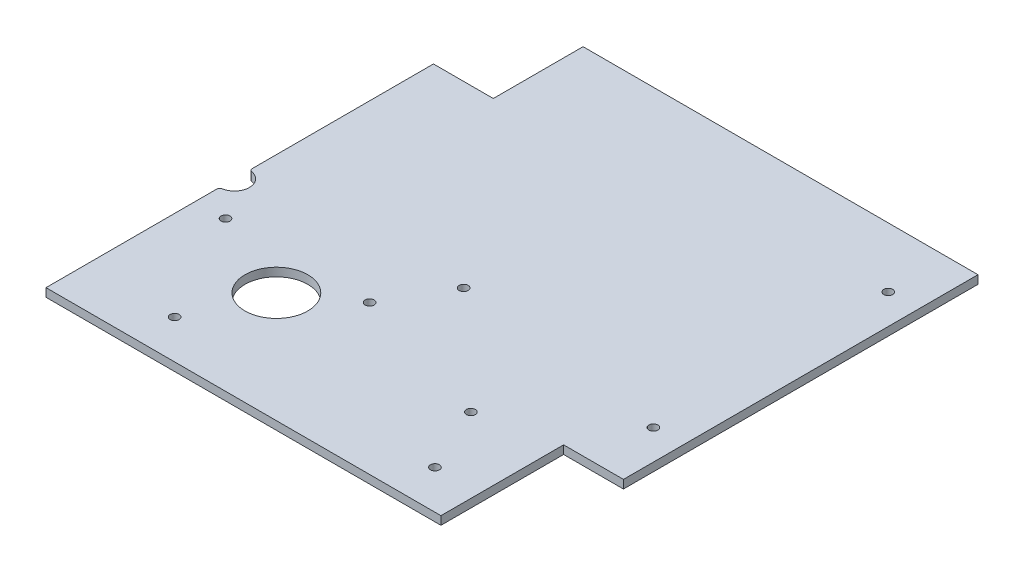
ISO-10303-21;
HEADER;
FILE_DESCRIPTION(('STEP AP214'),'2;1');
FILE_NAME('part.step','',(''),(''),'','','');
FILE_SCHEMA(('AUTOMOTIVE_DESIGN { 1 0 10303 214 1 1 1 1 }'));
ENDSEC;
DATA;
#1=APPLICATION_CONTEXT('core data for automotive mechanical design processes');
#2=APPLICATION_PROTOCOL_DEFINITION('international standard','automotive_design',2000,#1);
#3=PRODUCT_CONTEXT('',#1,'mechanical');
#4=PRODUCT('Part','Part','',(#3));
#5=PRODUCT_RELATED_PRODUCT_CATEGORY('part','',(#4));
#6=PRODUCT_DEFINITION_FORMATION('','',#4);
#7=PRODUCT_DEFINITION_CONTEXT('part definition',#1,'design');
#8=PRODUCT_DEFINITION('design','',#6,#7);
#9=PRODUCT_DEFINITION_SHAPE('','',#8);
#10=(LENGTH_UNIT() NAMED_UNIT(*) SI_UNIT(.MILLI.,.METRE.));
#11=(NAMED_UNIT(*) PLANE_ANGLE_UNIT() SI_UNIT($,.RADIAN.));
#12=(NAMED_UNIT(*) SI_UNIT($,.STERADIAN.) SOLID_ANGLE_UNIT());
#13=UNCERTAINTY_MEASURE_WITH_UNIT(LENGTH_MEASURE(1.E-05),#10,'distance_accuracy_value','');
#14=(GEOMETRIC_REPRESENTATION_CONTEXT(3) GLOBAL_UNCERTAINTY_ASSIGNED_CONTEXT((#13)) GLOBAL_UNIT_ASSIGNED_CONTEXT((#10,
#11,#12)) REPRESENTATION_CONTEXT('',''));
#15=CARTESIAN_POINT('',(0.,0.,0.));
#16=DIRECTION('',(0.,0.,1.));
#17=DIRECTION('',(1.,0.,0.));
#18=AXIS2_PLACEMENT_3D('',#15,#16,#17);
#19=CARTESIAN_POINT('',(-76.,2.8,0.));
#20=DIRECTION('',(-1.,0.,0.));
#21=DIRECTION('',(0.,0.,1.));
#22=AXIS2_PLACEMENT_3D('',#19,#20,#21);
#23=PLANE('',#22);
#24=DIRECTION('',(0.,0.,-1.));
#25=VECTOR('',#24,1.);
#26=CARTESIAN_POINT('',(-76.,2.8,0.));
#27=LINE('',#26,#25);
#28=CARTESIAN_POINT('',(-76.,2.8,79.75));
#29=VERTEX_POINT('',#28);
#30=CARTESIAN_POINT('',(-76.,2.8,22.6660797830996));
#31=VERTEX_POINT('',#30);
#32=EDGE_CURVE('E157',#29,#31,#27,.T.);
#33=ORIENTED_EDGE('',*,*,#32,.T.);
#34=DIRECTION('',(0.,-1.,0.));
#35=VECTOR('',#34,1.);
#36=CARTESIAN_POINT('',(-76.,0.,22.6660797830996));
#37=LINE('',#36,#35);
#38=CARTESIAN_POINT('',(-76.,0.,22.6660797830996));
#39=VERTEX_POINT('',#38);
#40=EDGE_CURVE('E133',#31,#39,#37,.T.);
#41=ORIENTED_EDGE('',*,*,#40,.T.);
#42=DIRECTION('',(0.,0.,-1.));
#43=VECTOR('',#42,1.);
#44=CARTESIAN_POINT('',(-76.,0.,0.));
#45=LINE('',#44,#43);
#46=CARTESIAN_POINT('',(-76.,0.,79.75));
#47=VERTEX_POINT('',#46);
#48=EDGE_CURVE('E193',#47,#39,#45,.T.);
#49=ORIENTED_EDGE('',*,*,#48,.F.);
#50=DIRECTION('',(0.,-1.,0.));
#51=VECTOR('',#50,1.);
#52=CARTESIAN_POINT('',(-76.,2.8,79.75));
#53=LINE('',#52,#51);
#54=EDGE_CURVE('E219',#29,#47,#53,.T.);
#55=ORIENTED_EDGE('',*,*,#54,.F.);
#56=EDGE_LOOP('',(#33,#41,#49,#55));
#57=FACE_BOUND('',#56,.T.);
#58=ADVANCED_FACE('F34',(#57),#23,.T.);
#59=CARTESIAN_POINT('',(0.,2.8,-79.75));
#60=DIRECTION('',(0.,0.,-1.));
#61=DIRECTION('',(-1.,0.,0.));
#62=AXIS2_PLACEMENT_3D('',#59,#60,#61);
#63=PLANE('',#62);
#64=DIRECTION('',(1.,0.,0.));
#65=VECTOR('',#64,1.);
#66=CARTESIAN_POINT('',(0.,0.,-79.75));
#67=LINE('',#66,#65);
#68=CARTESIAN_POINT('',(-56.,0.,-79.75));
#69=VERTEX_POINT('',#68);
#70=CARTESIAN_POINT('',(76.,0.,-79.75));
#71=VERTEX_POINT('',#70);
#72=EDGE_CURVE('E129',#69,#71,#67,.T.);
#73=ORIENTED_EDGE('',*,*,#72,.F.);
#74=DIRECTION('',(0.,-1.,0.));
#75=VECTOR('',#74,1.);
#76=CARTESIAN_POINT('',(-56.,2.8,-79.75));
#77=LINE('',#76,#75);
#78=CARTESIAN_POINT('',(-56.,2.8,-79.75));
#79=VERTEX_POINT('',#78);
#80=EDGE_CURVE('E123',#79,#69,#77,.T.);
#81=ORIENTED_EDGE('',*,*,#80,.F.);
#82=DIRECTION('',(1.,0.,0.));
#83=VECTOR('',#82,1.);
#84=CARTESIAN_POINT('',(0.,2.8,-79.75));
#85=LINE('',#84,#83);
#86=CARTESIAN_POINT('',(76.,2.8,-79.75));
#87=VERTEX_POINT('',#86);
#88=EDGE_CURVE('E127',#79,#87,#85,.T.);
#89=ORIENTED_EDGE('',*,*,#88,.T.);
#90=DIRECTION('',(0.,-1.,0.));
#91=VECTOR('',#90,1.);
#92=CARTESIAN_POINT('',(76.,2.8,-79.75));
#93=LINE('',#92,#91);
#94=EDGE_CURVE('E169',#87,#71,#93,.T.);
#95=ORIENTED_EDGE('',*,*,#94,.T.);
#96=EDGE_LOOP('',(#73,#81,#89,#95));
#97=FACE_BOUND('',#96,.T.);
#98=ADVANCED_FACE('F125',(#97),#63,.T.);
#99=CARTESIAN_POINT('',(-56.,2.8,0.));
#100=DIRECTION('',(1.,0.,0.));
#101=DIRECTION('',(0.,0.,-1.));
#102=AXIS2_PLACEMENT_3D('',#99,#100,#101);
#103=PLANE('',#102);
#104=DIRECTION('',(0.,0.,1.));
#105=VECTOR('',#104,1.);
#106=CARTESIAN_POINT('',(-56.,0.,0.));
#107=LINE('',#106,#105);
#108=CARTESIAN_POINT('',(-56.,0.,-49.75));
#109=VERTEX_POINT('',#108);
#110=EDGE_CURVE('E187',#69,#109,#107,.T.);
#111=ORIENTED_EDGE('',*,*,#110,.T.);
#112=DIRECTION('',(0.,-1.,0.));
#113=VECTOR('',#112,1.);
#114=CARTESIAN_POINT('',(-56.,2.8,-49.75));
#115=LINE('',#114,#113);
#116=CARTESIAN_POINT('',(-56.,2.8,-49.75));
#117=VERTEX_POINT('',#116);
#118=EDGE_CURVE('E134',#117,#109,#115,.T.);
#119=ORIENTED_EDGE('',*,*,#118,.F.);
#120=DIRECTION('',(0.,0.,1.));
#121=VECTOR('',#120,1.);
#122=CARTESIAN_POINT('',(-56.,2.8,0.));
#123=LINE('',#122,#121);
#124=EDGE_CURVE('E137',#79,#117,#123,.T.);
#125=ORIENTED_EDGE('',*,*,#124,.F.);
#126=ORIENTED_EDGE('',*,*,#80,.T.);
#127=EDGE_LOOP('',(#111,#119,#125,#126));
#128=FACE_BOUND('',#127,.T.);
#129=ADVANCED_FACE('F138',(#128),#103,.F.);
#130=CARTESIAN_POINT('',(0.,2.8,-49.75));
#131=DIRECTION('',(0.,0.,-1.));
#132=DIRECTION('',(-1.,0.,0.));
#133=AXIS2_PLACEMENT_3D('',#130,#131,#132);
#134=PLANE('',#133);
#135=DIRECTION('',(1.,0.,0.));
#136=VECTOR('',#135,1.);
#137=CARTESIAN_POINT('',(0.,0.,-49.75));
#138=LINE('',#137,#136);
#139=CARTESIAN_POINT('',(-76.,0.,-49.75));
#140=VERTEX_POINT('',#139);
#141=EDGE_CURVE('E189',#140,#109,#138,.T.);
#142=ORIENTED_EDGE('',*,*,#141,.F.);
#143=DIRECTION('',(0.,-1.,0.));
#144=VECTOR('',#143,1.);
#145=CARTESIAN_POINT('',(-76.,2.8,-49.75));
#146=LINE('',#145,#144);
#147=CARTESIAN_POINT('',(-76.,2.8,-49.75));
#148=VERTEX_POINT('',#147);
#149=EDGE_CURVE('E221',#148,#140,#146,.T.);
#150=ORIENTED_EDGE('',*,*,#149,.F.);
#151=DIRECTION('',(1.,0.,0.));
#152=VECTOR('',#151,1.);
#153=CARTESIAN_POINT('',(0.,2.8,-49.75));
#154=LINE('',#153,#152);
#155=EDGE_CURVE('E141',#148,#117,#154,.T.);
#156=ORIENTED_EDGE('',*,*,#155,.T.);
#157=ORIENTED_EDGE('',*,*,#118,.T.);
#158=EDGE_LOOP('',(#142,#150,#156,#157));
#159=FACE_BOUND('',#158,.T.);
#160=ADVANCED_FACE('F330',(#159),#134,.T.);
#161=CARTESIAN_POINT('',(-76.,0.,10.8339202169004));
#162=VERTEX_POINT('',#161);
#163=EDGE_CURVE('E192',#162,#140,#45,.T.);
#164=ORIENTED_EDGE('',*,*,#163,.F.);
#165=DIRECTION('',(0.,-1.,0.));
#166=VECTOR('',#165,1.);
#167=CARTESIAN_POINT('',(-76.,2.8,10.8339202169004));
#168=LINE('',#167,#166);
#169=CARTESIAN_POINT('',(-76.,2.8,10.8339202169004));
#170=VERTEX_POINT('',#169);
#171=EDGE_CURVE('E11',#162,#170,#168,.F.);
#172=ORIENTED_EDGE('',*,*,#171,.T.);
#173=EDGE_CURVE('E156',#170,#148,#27,.T.);
#174=ORIENTED_EDGE('',*,*,#173,.T.);
#175=ORIENTED_EDGE('',*,*,#149,.T.);
#176=EDGE_LOOP('',(#164,#172,#174,#175));
#177=FACE_BOUND('',#176,.T.);
#178=ADVANCED_FACE('F321',(#177),#23,.T.);
#179=CARTESIAN_POINT('',(0.,2.8,79.75));
#180=DIRECTION('',(0.,0.,-1.));
#181=DIRECTION('',(-1.,0.,0.));
#182=AXIS2_PLACEMENT_3D('',#179,#180,#181);
#183=PLANE('',#182);
#184=DIRECTION('',(1.,0.,0.));
#185=VECTOR('',#184,1.);
#186=CARTESIAN_POINT('',(0.,0.,79.75));
#187=LINE('',#186,#185);
#188=CARTESIAN_POINT('',(56.,0.,79.75));
#189=VERTEX_POINT('',#188);
#190=EDGE_CURVE('E196',#47,#189,#187,.T.);
#191=ORIENTED_EDGE('',*,*,#190,.T.);
#192=DIRECTION('',(0.,-1.,0.));
#193=VECTOR('',#192,1.);
#194=CARTESIAN_POINT('',(56.,2.8,79.75));
#195=LINE('',#194,#193);
#196=CARTESIAN_POINT('',(56.,2.8,79.75));
#197=VERTEX_POINT('',#196);
#198=EDGE_CURVE('E216',#197,#189,#195,.T.);
#199=ORIENTED_EDGE('',*,*,#198,.F.);
#200=DIRECTION('',(1.,0.,0.));
#201=VECTOR('',#200,1.);
#202=CARTESIAN_POINT('',(0.,2.8,79.75));
#203=LINE('',#202,#201);
#204=EDGE_CURVE('E160',#29,#197,#203,.T.);
#205=ORIENTED_EDGE('',*,*,#204,.F.);
#206=ORIENTED_EDGE('',*,*,#54,.T.);
#207=EDGE_LOOP('',(#191,#199,#205,#206));
#208=FACE_BOUND('',#207,.T.);
#209=ADVANCED_FACE('F329',(#208),#183,.F.);
#210=CARTESIAN_POINT('',(56.,2.8,0.));
#211=DIRECTION('',(-1.,0.,0.));
#212=DIRECTION('',(0.,0.,1.));
#213=AXIS2_PLACEMENT_3D('',#210,#211,#212);
#214=PLANE('',#213);
#215=DIRECTION('',(0.,0.,-1.));
#216=VECTOR('',#215,1.);
#217=CARTESIAN_POINT('',(56.,0.,0.));
#218=LINE('',#217,#216);
#219=CARTESIAN_POINT('',(56.,0.,38.75));
#220=VERTEX_POINT('',#219);
#221=EDGE_CURVE('E199',#189,#220,#218,.T.);
#222=ORIENTED_EDGE('',*,*,#221,.T.);
#223=DIRECTION('',(0.,-1.,0.));
#224=VECTOR('',#223,1.);
#225=CARTESIAN_POINT('',(56.,2.8,38.75));
#226=LINE('',#225,#224);
#227=CARTESIAN_POINT('',(56.,2.8,38.75));
#228=VERTEX_POINT('',#227);
#229=EDGE_CURVE('E213',#228,#220,#226,.T.);
#230=ORIENTED_EDGE('',*,*,#229,.F.);
#231=DIRECTION('',(0.,0.,-1.));
#232=VECTOR('',#231,1.);
#233=CARTESIAN_POINT('',(56.,2.8,0.));
#234=LINE('',#233,#232);
#235=EDGE_CURVE('E163',#197,#228,#234,.T.);
#236=ORIENTED_EDGE('',*,*,#235,.F.);
#237=ORIENTED_EDGE('',*,*,#198,.T.);
#238=EDGE_LOOP('',(#222,#230,#236,#237));
#239=FACE_BOUND('',#238,.T.);
#240=ADVANCED_FACE('F336',(#239),#214,.F.);
#241=CARTESIAN_POINT('',(0.,2.8,38.75));
#242=DIRECTION('',(0.,0.,-1.));
#243=DIRECTION('',(-1.,0.,0.));
#244=AXIS2_PLACEMENT_3D('',#241,#242,#243);
#245=PLANE('',#244);
#246=DIRECTION('',(1.,0.,0.));
#247=VECTOR('',#246,1.);
#248=CARTESIAN_POINT('',(0.,0.,38.75));
#249=LINE('',#248,#247);
#250=CARTESIAN_POINT('',(76.,0.,38.75));
#251=VERTEX_POINT('',#250);
#252=EDGE_CURVE('E202',#220,#251,#249,.T.);
#253=ORIENTED_EDGE('',*,*,#252,.T.);
#254=DIRECTION('',(0.,-1.,0.));
#255=VECTOR('',#254,1.);
#256=CARTESIAN_POINT('',(76.,2.8,38.75));
#257=LINE('',#256,#255);
#258=CARTESIAN_POINT('',(76.,2.8,38.75));
#259=VERTEX_POINT('',#258);
#260=EDGE_CURVE('E210',#259,#251,#257,.T.);
#261=ORIENTED_EDGE('',*,*,#260,.F.);
#262=DIRECTION('',(1.,0.,0.));
#263=VECTOR('',#262,1.);
#264=CARTESIAN_POINT('',(0.,2.8,38.75));
#265=LINE('',#264,#263);
#266=EDGE_CURVE('E166',#228,#259,#265,.T.);
#267=ORIENTED_EDGE('',*,*,#266,.F.);
#268=ORIENTED_EDGE('',*,*,#229,.T.);
#269=EDGE_LOOP('',(#253,#261,#267,#268));
#270=FACE_BOUND('',#269,.T.);
#271=ADVANCED_FACE('F302',(#270),#245,.F.);
#272=CARTESIAN_POINT('',(-66.,2.8,29.75));
#273=DIRECTION('',(0.,-1.,0.));
#274=DIRECTION('',(0.,0.,-1.));
#275=AXIS2_PLACEMENT_3D('',#272,#273,#274);
#276=CYLINDRICAL_SURFACE('',#275,1.5);
#277=CARTESIAN_POINT('',(-66.,2.8,29.75));
#278=DIRECTION('',(0.,1.,0.));
#279=DIRECTION('',(0.,0.,1.));
#280=AXIS2_PLACEMENT_3D('',#277,#278,#279);
#281=CIRCLE('',#280,1.5);
#282=CARTESIAN_POINT('',(-66.,2.8,31.25));
#283=VERTEX_POINT('',#282);
#284=EDGE_CURVE('E148',#283,#283,#281,.T.);
#285=ORIENTED_EDGE('',*,*,#284,.T.);
#286=EDGE_LOOP('',(#285));
#287=FACE_BOUND('',#286,.T.);
#288=CARTESIAN_POINT('',(-66.,0.,29.75));
#289=DIRECTION('',(0.,1.,0.));
#290=DIRECTION('',(0.,0.,1.));
#291=AXIS2_PLACEMENT_3D('',#288,#289,#290);
#292=CIRCLE('',#291,1.5);
#293=CARTESIAN_POINT('',(-66.,0.,31.25));
#294=VERTEX_POINT('',#293);
#295=EDGE_CURVE('E183',#294,#294,#292,.T.);
#296=ORIENTED_EDGE('',*,*,#295,.F.);
#297=EDGE_LOOP('',(#296));
#298=FACE_BOUND('',#297,.T.);
#299=ADVANCED_FACE('F299',(#287,#298),#276,.F.);
#300=CARTESIAN_POINT('',(41.,2.8,66.75));
#301=DIRECTION('',(0.,-1.,0.));
#302=DIRECTION('',(0.,0.,-1.));
#303=AXIS2_PLACEMENT_3D('',#300,#301,#302);
#304=CYLINDRICAL_SURFACE('',#303,1.5);
#305=CARTESIAN_POINT('',(41.,2.8,66.75));
#306=DIRECTION('',(0.,1.,0.));
#307=DIRECTION('',(0.,0.,1.));
#308=AXIS2_PLACEMENT_3D('',#305,#306,#307);
#309=CIRCLE('',#308,1.5);
#310=CARTESIAN_POINT('',(41.,2.8,68.25));
#311=VERTEX_POINT('',#310);
#312=EDGE_CURVE('E151',#311,#311,#309,.T.);
#313=ORIENTED_EDGE('',*,*,#312,.T.);
#314=EDGE_LOOP('',(#313));
#315=FACE_BOUND('',#314,.T.);
#316=CARTESIAN_POINT('',(41.,0.,66.75));
#317=DIRECTION('',(0.,1.,0.));
#318=DIRECTION('',(0.,0.,1.));
#319=AXIS2_PLACEMENT_3D('',#316,#317,#318);
#320=CIRCLE('',#319,1.5);
#321=CARTESIAN_POINT('',(41.,0.,68.25));
#322=VERTEX_POINT('',#321);
#323=EDGE_CURVE('E180',#322,#322,#320,.T.);
#324=ORIENTED_EDGE('',*,*,#323,.F.);
#325=EDGE_LOOP('',(#324));
#326=FACE_BOUND('',#325,.T.);
#327=ADVANCED_FACE('F290',(#315,#326),#304,.F.);
#328=CARTESIAN_POINT('',(-46.,2.8,66.75));
#329=DIRECTION('',(0.,-1.,0.));
#330=DIRECTION('',(0.,0.,-1.));
#331=AXIS2_PLACEMENT_3D('',#328,#329,#330);
#332=CYLINDRICAL_SURFACE('',#331,1.5);
#333=CARTESIAN_POINT('',(-46.,2.8,66.75));
#334=DIRECTION('',(0.,1.,0.));
#335=DIRECTION('',(0.,0.,1.));
#336=AXIS2_PLACEMENT_3D('',#333,#334,#335);
#337=CIRCLE('',#336,1.5);
#338=CARTESIAN_POINT('',(-46.,2.8,68.25));
#339=VERTEX_POINT('',#338);
#340=EDGE_CURVE('E285',#339,#339,#337,.T.);
#341=ORIENTED_EDGE('',*,*,#340,.T.);
#342=EDGE_LOOP('',(#341));
#343=FACE_BOUND('',#342,.T.);
#344=CARTESIAN_POINT('',(-46.,0.,66.75));
#345=DIRECTION('',(0.,1.,0.));
#346=DIRECTION('',(0.,0.,1.));
#347=AXIS2_PLACEMENT_3D('',#344,#345,#346);
#348=CIRCLE('',#347,1.5);
#349=CARTESIAN_POINT('',(-46.,0.,68.25));
#350=VERTEX_POINT('',#349);
#351=EDGE_CURVE('E177',#350,#350,#348,.T.);
#352=ORIENTED_EDGE('',*,*,#351,.F.);
#353=EDGE_LOOP('',(#352));
#354=FACE_BOUND('',#353,.T.);
#355=ADVANCED_FACE('F359',(#343,#354),#332,.F.);
#356=CARTESIAN_POINT('',(66.,2.8,-59.75));
#357=DIRECTION('',(0.,-1.,0.));
#358=DIRECTION('',(0.,0.,-1.));
#359=AXIS2_PLACEMENT_3D('',#356,#357,#358);
#360=CYLINDRICAL_SURFACE('',#359,1.5);
#361=CARTESIAN_POINT('',(66.,2.8,-59.75));
#362=DIRECTION('',(0.,1.,0.));
#363=DIRECTION('',(0.,0.,1.));
#364=AXIS2_PLACEMENT_3D('',#361,#362,#363);
#365=CIRCLE('',#364,1.5);
#366=CARTESIAN_POINT('',(66.,2.8,-58.25));
#367=VERTEX_POINT('',#366);
#368=EDGE_CURVE('E282',#367,#367,#365,.T.);
#369=ORIENTED_EDGE('',*,*,#368,.T.);
#370=EDGE_LOOP('',(#369));
#371=FACE_BOUND('',#370,.T.);
#372=CARTESIAN_POINT('',(66.,0.,-59.75));
#373=DIRECTION('',(0.,1.,0.));
#374=DIRECTION('',(0.,0.,1.));
#375=AXIS2_PLACEMENT_3D('',#372,#373,#374);
#376=CIRCLE('',#375,1.5);
#377=CARTESIAN_POINT('',(66.,0.,-58.25));
#378=VERTEX_POINT('',#377);
#379=EDGE_CURVE('E173',#378,#378,#376,.T.);
#380=ORIENTED_EDGE('',*,*,#379,.F.);
#381=EDGE_LOOP('',(#380));
#382=FACE_BOUND('',#381,.T.);
#383=ADVANCED_FACE('F355',(#371,#382),#360,.F.);
#384=CARTESIAN_POINT('',(66.,2.8,18.75));
#385=DIRECTION('',(0.,-1.,0.));
#386=DIRECTION('',(0.,0.,-1.));
#387=AXIS2_PLACEMENT_3D('',#384,#385,#386);
#388=CYLINDRICAL_SURFACE('',#387,1.5);
#389=CARTESIAN_POINT('',(66.,2.8,18.75));
#390=DIRECTION('',(0.,1.,0.));
#391=DIRECTION('',(0.,0.,1.));
#392=AXIS2_PLACEMENT_3D('',#389,#390,#391);
#393=CIRCLE('',#392,1.5);
#394=CARTESIAN_POINT('',(66.,2.8,20.25));
#395=VERTEX_POINT('',#394);
#396=EDGE_CURVE('E208',#395,#395,#393,.T.);
#397=ORIENTED_EDGE('',*,*,#396,.T.);
#398=EDGE_LOOP('',(#397));
#399=FACE_BOUND('',#398,.T.);
#400=CARTESIAN_POINT('',(66.,0.,18.75));
#401=DIRECTION('',(0.,1.,0.));
#402=DIRECTION('',(0.,0.,1.));
#403=AXIS2_PLACEMENT_3D('',#400,#401,#402);
#404=CIRCLE('',#403,1.5);
#405=CARTESIAN_POINT('',(66.,0.,20.25));
#406=VERTEX_POINT('',#405);
#407=EDGE_CURVE('E170',#406,#406,#404,.T.);
#408=ORIENTED_EDGE('',*,*,#407,.F.);
#409=EDGE_LOOP('',(#408));
#410=FACE_BOUND('',#409,.T.);
#411=ADVANCED_FACE('F352',(#399,#410),#388,.F.);
#412=CARTESIAN_POINT('',(76.,2.8,0.));
#413=DIRECTION('',(-1.,0.,0.));
#414=DIRECTION('',(0.,0.,1.));
#415=AXIS2_PLACEMENT_3D('',#412,#413,#414);
#416=PLANE('',#415);
#417=DIRECTION('',(0.,0.,-1.));
#418=VECTOR('',#417,1.);
#419=CARTESIAN_POINT('',(76.,0.,0.));
#420=LINE('',#419,#418);
#421=EDGE_CURVE('E205',#251,#71,#420,.T.);
#422=ORIENTED_EDGE('',*,*,#421,.T.);
#423=ORIENTED_EDGE('',*,*,#94,.F.);
#424=DIRECTION('',(0.,0.,-1.));
#425=VECTOR('',#424,1.);
#426=CARTESIAN_POINT('',(76.,2.8,0.));
#427=LINE('',#426,#425);
#428=EDGE_CURVE('E146',#259,#87,#427,.T.);
#429=ORIENTED_EDGE('',*,*,#428,.F.);
#430=ORIENTED_EDGE('',*,*,#260,.T.);
#431=EDGE_LOOP('',(#422,#423,#429,#430));
#432=FACE_BOUND('',#431,.T.);
#433=ADVANCED_FACE('F295',(#432),#416,.F.);
#434=CARTESIAN_POINT('',(0.,2.8,0.));
#435=DIRECTION('',(0.,1.,0.));
#436=DIRECTION('',(0.,0.,1.));
#437=AXIS2_PLACEMENT_3D('',#434,#435,#436);
#438=PLANE('',#437);
#439=CARTESIAN_POINT('',(-76.,2.8,16.75));
#440=DIRECTION('',(0.,1.,0.));
#441=DIRECTION('',(0.,0.,1.));
#442=AXIS2_PLACEMENT_3D('',#439,#440,#441);
#443=CIRCLE('',#442,5.);
#444=CARTESIAN_POINT('',(-75.1666666666667,2.8,21.6800664859163));
#445=VERTEX_POINT('',#444);
#446=CARTESIAN_POINT('',(-75.1666666666667,2.8,11.8199335140837));
#447=VERTEX_POINT('',#446);
#448=EDGE_CURVE('E237',#445,#447,#443,.T.);
#449=ORIENTED_EDGE('',*,*,#448,.F.);
#450=CARTESIAN_POINT('',(-75.,2.8,22.6660797830996));
#451=DIRECTION('',(0.,1.,0.));
#452=DIRECTION('',(0.,0.,1.));
#453=AXIS2_PLACEMENT_3D('',#450,#451,#452);
#454=CIRCLE('',#453,1.);
#455=EDGE_CURVE('E42',#445,#31,#454,.T.);
#456=ORIENTED_EDGE('',*,*,#455,.T.);
#457=ORIENTED_EDGE('',*,*,#32,.F.);
#458=ORIENTED_EDGE('',*,*,#204,.T.);
#459=ORIENTED_EDGE('',*,*,#235,.T.);
#460=ORIENTED_EDGE('',*,*,#266,.T.);
#461=ORIENTED_EDGE('',*,*,#428,.T.);
#462=ORIENTED_EDGE('',*,*,#88,.F.);
#463=ORIENTED_EDGE('',*,*,#124,.T.);
#464=ORIENTED_EDGE('',*,*,#155,.F.);
#465=ORIENTED_EDGE('',*,*,#173,.F.);
#466=CARTESIAN_POINT('',(-75.,2.8,10.8339202169004));
#467=DIRECTION('',(0.,1.,0.));
#468=DIRECTION('',(0.,0.,1.));
#469=AXIS2_PLACEMENT_3D('',#466,#467,#468);
#470=CIRCLE('',#469,1.);
#471=EDGE_CURVE('E49',#170,#447,#470,.T.);
#472=ORIENTED_EDGE('',*,*,#471,.T.);
#473=EDGE_LOOP('',(#449,#456,#457,#458,#459,#460,#461,#462,#463,#464,#465,#472));
#474=FACE_BOUND('',#473,.T.);
#475=CARTESIAN_POINT('',(-36.,2.8,42.75));
#476=DIRECTION('',(0.,1.,0.));
#477=DIRECTION('',(0.,0.,1.));
#478=AXIS2_PLACEMENT_3D('',#475,#476,#477);
#479=CIRCLE('',#478,10.5);
#480=CARTESIAN_POINT('',(-36.,2.8,53.25));
#481=VERTEX_POINT('',#480);
#482=EDGE_CURVE('E254',#481,#481,#479,.T.);
#483=ORIENTED_EDGE('',*,*,#482,.F.);
#484=EDGE_LOOP('',(#483));
#485=FACE_BOUND('',#484,.T.);
#486=CARTESIAN_POINT('',(31.,2.8,44.75));
#487=DIRECTION('',(0.,1.,0.));
#488=DIRECTION('',(0.,0.,1.));
#489=AXIS2_PLACEMENT_3D('',#486,#487,#488);
#490=CIRCLE('',#489,1.5);
#491=CARTESIAN_POINT('',(31.,2.8,46.25));
#492=VERTEX_POINT('',#491);
#493=EDGE_CURVE('E264',#492,#492,#490,.T.);
#494=ORIENTED_EDGE('',*,*,#493,.F.);
#495=EDGE_LOOP('',(#494));
#496=FACE_BOUND('',#495,.T.);
#497=CARTESIAN_POINT('',(-17.6182574873298,2.8,29.9592921435213));
#498=DIRECTION('',(0.,1.,0.));
#499=DIRECTION('',(0.,0.,1.));
#500=AXIS2_PLACEMENT_3D('',#497,#498,#499);
#501=CIRCLE('',#500,1.5);
#502=CARTESIAN_POINT('',(-17.6182574873298,2.8,31.4592921435213));
#503=VERTEX_POINT('',#502);
#504=EDGE_CURVE('E270',#503,#503,#501,.T.);
#505=ORIENTED_EDGE('',*,*,#504,.F.);
#506=EDGE_LOOP('',(#505));
#507=FACE_BOUND('',#506,.T.);
#508=CARTESIAN_POINT('',(-6.11825748732994,2.8,10.0407078564792));
#509=DIRECTION('',(0.,1.,0.));
#510=DIRECTION('',(0.,0.,1.));
#511=AXIS2_PLACEMENT_3D('',#508,#509,#510);
#512=CIRCLE('',#511,1.5);
#513=CARTESIAN_POINT('',(-6.11825748732994,2.8,11.5407078564792));
#514=VERTEX_POINT('',#513);
#515=EDGE_CURVE('E263',#514,#514,#512,.T.);
#516=ORIENTED_EDGE('',*,*,#515,.F.);
#517=EDGE_LOOP('',(#516));
#518=FACE_BOUND('',#517,.T.);
#519=ORIENTED_EDGE('',*,*,#396,.F.);
#520=EDGE_LOOP('',(#519));
#521=FACE_BOUND('',#520,.T.);
#522=ORIENTED_EDGE('',*,*,#368,.F.);
#523=EDGE_LOOP('',(#522));
#524=FACE_BOUND('',#523,.T.);
#525=ORIENTED_EDGE('',*,*,#340,.F.);
#526=EDGE_LOOP('',(#525));
#527=FACE_BOUND('',#526,.T.);
#528=ORIENTED_EDGE('',*,*,#312,.F.);
#529=EDGE_LOOP('',(#528));
#530=FACE_BOUND('',#529,.T.);
#531=ORIENTED_EDGE('',*,*,#284,.F.);
#532=EDGE_LOOP('',(#531));
#533=FACE_BOUND('',#532,.T.);
#534=ADVANCED_FACE('F143',(#474,#485,#496,#507,#518,#521,#524,#527,#530,#533),#438,.T.);
#535=CARTESIAN_POINT('',(0.,0.,0.));
#536=DIRECTION('',(0.,1.,0.));
#537=DIRECTION('',(0.,0.,1.));
#538=AXIS2_PLACEMENT_3D('',#535,#536,#537);
#539=PLANE('',#538);
#540=CARTESIAN_POINT('',(-36.,0.,42.75));
#541=DIRECTION('',(0.,1.,0.));
#542=DIRECTION('',(0.,0.,1.));
#543=AXIS2_PLACEMENT_3D('',#540,#541,#542);
#544=CIRCLE('',#543,10.5);
#545=CARTESIAN_POINT('',(-36.,0.,53.25));
#546=VERTEX_POINT('',#545);
#547=EDGE_CURVE('E257',#546,#546,#544,.F.);
#548=ORIENTED_EDGE('',*,*,#547,.F.);
#549=EDGE_LOOP('',(#548));
#550=FACE_BOUND('',#549,.T.);
#551=CARTESIAN_POINT('',(31.,0.,44.75));
#552=DIRECTION('',(0.,1.,0.));
#553=DIRECTION('',(0.,0.,1.));
#554=AXIS2_PLACEMENT_3D('',#551,#552,#553);
#555=CIRCLE('',#554,1.5);
#556=CARTESIAN_POINT('',(31.,0.,46.25));
#557=VERTEX_POINT('',#556);
#558=EDGE_CURVE('E174',#557,#557,#555,.F.);
#559=ORIENTED_EDGE('',*,*,#558,.F.);
#560=EDGE_LOOP('',(#559));
#561=FACE_BOUND('',#560,.T.);
#562=CARTESIAN_POINT('',(-17.6182574873298,0.,29.9592921435213));
#563=DIRECTION('',(0.,1.,0.));
#564=DIRECTION('',(0.,0.,1.));
#565=AXIS2_PLACEMENT_3D('',#562,#563,#564);
#566=CIRCLE('',#565,1.5);
#567=CARTESIAN_POINT('',(-17.6182574873298,0.,31.4592921435213));
#568=VERTEX_POINT('',#567);
#569=EDGE_CURVE('E267',#568,#568,#566,.F.);
#570=ORIENTED_EDGE('',*,*,#569,.F.);
#571=EDGE_LOOP('',(#570));
#572=FACE_BOUND('',#571,.T.);
#573=CARTESIAN_POINT('',(-6.11825748732994,0.,10.0407078564792));
#574=DIRECTION('',(0.,1.,0.));
#575=DIRECTION('',(0.,0.,1.));
#576=AXIS2_PLACEMENT_3D('',#573,#574,#575);
#577=CIRCLE('',#576,1.5);
#578=CARTESIAN_POINT('',(-6.11825748732994,0.,11.5407078564792));
#579=VERTEX_POINT('',#578);
#580=EDGE_CURVE('E273',#579,#579,#577,.F.);
#581=ORIENTED_EDGE('',*,*,#580,.F.);
#582=EDGE_LOOP('',(#581));
#583=FACE_BOUND('',#582,.T.);
#584=ORIENTED_EDGE('',*,*,#407,.T.);
#585=EDGE_LOOP('',(#584));
#586=FACE_BOUND('',#585,.T.);
#587=ORIENTED_EDGE('',*,*,#379,.T.);
#588=EDGE_LOOP('',(#587));
#589=FACE_BOUND('',#588,.T.);
#590=ORIENTED_EDGE('',*,*,#351,.T.);
#591=EDGE_LOOP('',(#590));
#592=FACE_BOUND('',#591,.T.);
#593=ORIENTED_EDGE('',*,*,#323,.T.);
#594=EDGE_LOOP('',(#593));
#595=FACE_BOUND('',#594,.T.);
#596=ORIENTED_EDGE('',*,*,#295,.T.);
#597=EDGE_LOOP('',(#596));
#598=FACE_BOUND('',#597,.T.);
#599=ORIENTED_EDGE('',*,*,#48,.T.);
#600=CARTESIAN_POINT('',(-75.,0.,22.6660797830996));
#601=DIRECTION('',(0.,1.,0.));
#602=DIRECTION('',(0.,0.,1.));
#603=AXIS2_PLACEMENT_3D('',#600,#601,#602);
#604=CIRCLE('',#603,1.);
#605=CARTESIAN_POINT('',(-75.1666666666667,0.,21.6800664859163));
#606=VERTEX_POINT('',#605);
#607=EDGE_CURVE('E229',#39,#606,#604,.F.);
#608=ORIENTED_EDGE('',*,*,#607,.T.);
#609=CARTESIAN_POINT('',(-76.,0.,16.75));
#610=DIRECTION('',(0.,1.,0.));
#611=DIRECTION('',(0.,0.,1.));
#612=AXIS2_PLACEMENT_3D('',#609,#610,#611);
#613=CIRCLE('',#612,5.);
#614=CARTESIAN_POINT('',(-75.1666666666667,0.,11.8199335140837));
#615=VERTEX_POINT('',#614);
#616=EDGE_CURVE('E249',#615,#606,#613,.F.);
#617=ORIENTED_EDGE('',*,*,#616,.F.);
#618=CARTESIAN_POINT('',(-75.,0.,10.8339202169004));
#619=DIRECTION('',(0.,1.,0.));
#620=DIRECTION('',(0.,0.,1.));
#621=AXIS2_PLACEMENT_3D('',#618,#619,#620);
#622=CIRCLE('',#621,1.);
#623=EDGE_CURVE('E227',#615,#162,#622,.F.);
#624=ORIENTED_EDGE('',*,*,#623,.T.);
#625=ORIENTED_EDGE('',*,*,#163,.T.);
#626=ORIENTED_EDGE('',*,*,#141,.T.);
#627=ORIENTED_EDGE('',*,*,#110,.F.);
#628=ORIENTED_EDGE('',*,*,#72,.T.);
#629=ORIENTED_EDGE('',*,*,#421,.F.);
#630=ORIENTED_EDGE('',*,*,#252,.F.);
#631=ORIENTED_EDGE('',*,*,#221,.F.);
#632=ORIENTED_EDGE('',*,*,#190,.F.);
#633=EDGE_LOOP('',(#599,#608,#617,#624,#625,#626,#627,#628,#629,#630,#631,#632));
#634=FACE_BOUND('',#633,.T.);
#635=ADVANCED_FACE('F248',(#550,#561,#572,#583,#586,#589,#592,#595,#598,#634),#539,.F.);
#636=CARTESIAN_POINT('',(-6.11825748732994,-0.00100000000000013,10.0407078564792));
#637=DIRECTION('',(0.,1.,0.));
#638=DIRECTION('',(0.,0.,1.));
#639=AXIS2_PLACEMENT_3D('',#636,#637,#638);
#640=CYLINDRICAL_SURFACE('',#639,1.5);
#641=ORIENTED_EDGE('',*,*,#515,.T.);
#642=EDGE_LOOP('',(#641));
#643=FACE_BOUND('',#642,.T.);
#644=ORIENTED_EDGE('',*,*,#580,.T.);
#645=EDGE_LOOP('',(#644));
#646=FACE_BOUND('',#645,.T.);
#647=ADVANCED_FACE('F307',(#643,#646),#640,.F.);
#648=CARTESIAN_POINT('',(-17.6182574873298,-0.00100000000000013,29.9592921435213));
#649=DIRECTION('',(0.,1.,0.));
#650=DIRECTION('',(0.,0.,1.));
#651=AXIS2_PLACEMENT_3D('',#648,#649,#650);
#652=CYLINDRICAL_SURFACE('',#651,1.5);
#653=ORIENTED_EDGE('',*,*,#504,.T.);
#654=EDGE_LOOP('',(#653));
#655=FACE_BOUND('',#654,.T.);
#656=ORIENTED_EDGE('',*,*,#569,.T.);
#657=EDGE_LOOP('',(#656));
#658=FACE_BOUND('',#657,.T.);
#659=ADVANCED_FACE('F313',(#655,#658),#652,.F.);
#660=CARTESIAN_POINT('',(31.,-0.00100000000000013,44.75));
#661=DIRECTION('',(0.,1.,0.));
#662=DIRECTION('',(0.,0.,1.));
#663=AXIS2_PLACEMENT_3D('',#660,#661,#662);
#664=CYLINDRICAL_SURFACE('',#663,1.5);
#665=ORIENTED_EDGE('',*,*,#493,.T.);
#666=EDGE_LOOP('',(#665));
#667=FACE_BOUND('',#666,.T.);
#668=ORIENTED_EDGE('',*,*,#558,.T.);
#669=EDGE_LOOP('',(#668));
#670=FACE_BOUND('',#669,.T.);
#671=ADVANCED_FACE('F455',(#667,#670),#664,.F.);
#672=CARTESIAN_POINT('',(-36.,-0.00100000000000013,42.75));
#673=DIRECTION('',(0.,1.,0.));
#674=DIRECTION('',(0.,0.,1.));
#675=AXIS2_PLACEMENT_3D('',#672,#673,#674);
#676=CYLINDRICAL_SURFACE('',#675,10.5);
#677=ORIENTED_EDGE('',*,*,#482,.T.);
#678=EDGE_LOOP('',(#677));
#679=FACE_BOUND('',#678,.T.);
#680=ORIENTED_EDGE('',*,*,#547,.T.);
#681=EDGE_LOOP('',(#680));
#682=FACE_BOUND('',#681,.T.);
#683=ADVANCED_FACE('F349',(#679,#682),#676,.F.);
#684=CARTESIAN_POINT('',(-76.,-0.00100000000000013,16.75));
#685=DIRECTION('',(0.,1.,0.));
#686=DIRECTION('',(0.,0.,1.));
#687=AXIS2_PLACEMENT_3D('',#684,#685,#686);
#688=CYLINDRICAL_SURFACE('',#687,5.);
#689=ORIENTED_EDGE('',*,*,#616,.T.);
#690=DIRECTION('',(0.,1.,0.));
#691=VECTOR('',#690,1.);
#692=CARTESIAN_POINT('',(-75.1666666666667,-0.00100000000000013,21.6800664859164));
#693=LINE('',#692,#691);
#694=EDGE_CURVE('E233',#606,#445,#693,.T.);
#695=ORIENTED_EDGE('',*,*,#694,.T.);
#696=ORIENTED_EDGE('',*,*,#448,.T.);
#697=DIRECTION('',(0.,1.,0.));
#698=VECTOR('',#697,1.);
#699=CARTESIAN_POINT('',(-75.1666666666667,-0.00100000000000013,11.8199335140837));
#700=LINE('',#699,#698);
#701=EDGE_CURVE('E231',#447,#615,#700,.F.);
#702=ORIENTED_EDGE('',*,*,#701,.T.);
#703=EDGE_LOOP('',(#689,#695,#696,#702));
#704=FACE_BOUND('',#703,.T.);
#705=ADVANCED_FACE('F253',(#704),#688,.F.);
#706=CARTESIAN_POINT('',(-75.,-0.00100000000000013,22.6660797830996));
#707=DIRECTION('',(0.,1.,0.));
#708=DIRECTION('',(0.,0.,1.));
#709=AXIS2_PLACEMENT_3D('',#706,#707,#708);
#710=CYLINDRICAL_SURFACE('',#709,1.);
#711=ORIENTED_EDGE('',*,*,#455,.F.);
#712=ORIENTED_EDGE('',*,*,#694,.F.);
#713=ORIENTED_EDGE('',*,*,#607,.F.);
#714=ORIENTED_EDGE('',*,*,#40,.F.);
#715=EDGE_LOOP('',(#711,#712,#713,#714));
#716=FACE_BOUND('',#715,.T.);
#717=ADVANCED_FACE('F244',(#716),#710,.T.);
#718=CARTESIAN_POINT('',(-75.,-0.00100000000000013,10.8339202169004));
#719=DIRECTION('',(0.,1.,0.));
#720=DIRECTION('',(0.,0.,1.));
#721=AXIS2_PLACEMENT_3D('',#718,#719,#720);
#722=CYLINDRICAL_SURFACE('',#721,1.);
#723=ORIENTED_EDGE('',*,*,#623,.F.);
#724=ORIENTED_EDGE('',*,*,#701,.F.);
#725=ORIENTED_EDGE('',*,*,#471,.F.);
#726=ORIENTED_EDGE('',*,*,#171,.F.);
#727=EDGE_LOOP('',(#723,#724,#725,#726));
#728=FACE_BOUND('',#727,.T.);
#729=ADVANCED_FACE('F36',(#728),#722,.T.);
#730=CLOSED_SHELL('',(#58,#98,#129,#160,#178,#209,#240,#271,#299,#327,#355,#383,#411,#433,#534,
#635,#647,#659,#671,#683,#705,#717,#729));
#731=MANIFOLD_SOLID_BREP('B2',#730);
#732=ADVANCED_BREP_SHAPE_REPRESENTATION('',(#18,#731),#14);
#733=SHAPE_DEFINITION_REPRESENTATION(#9,#732);
ENDSEC;
END-ISO-10303-21;
